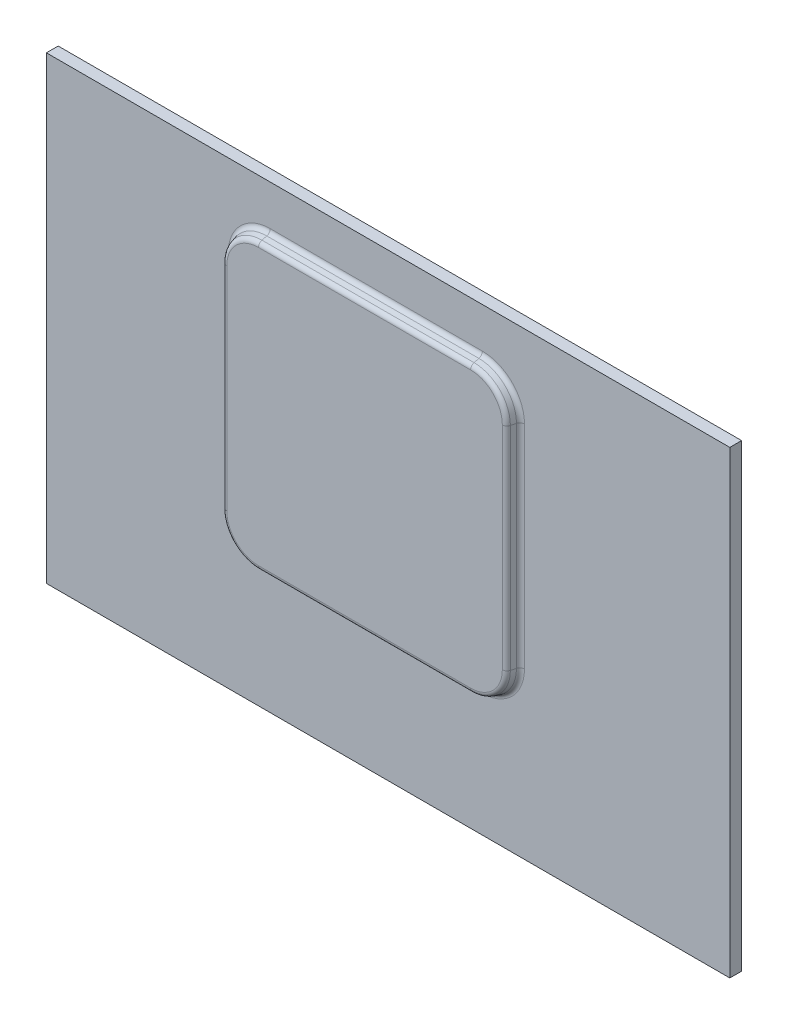
ISO-10303-21;
HEADER;
FILE_DESCRIPTION(('STEP AP214'),'2;1');
FILE_NAME('part.step','',(''),(''),'','','');
FILE_SCHEMA(('AUTOMOTIVE_DESIGN { 1 0 10303 214 1 1 1 1 }'));
ENDSEC;
DATA;
#1=APPLICATION_CONTEXT('core data for automotive mechanical design processes');
#2=APPLICATION_PROTOCOL_DEFINITION('international standard','automotive_design',2000,#1);
#3=PRODUCT_CONTEXT('',#1,'mechanical');
#4=PRODUCT('Part','Part','',(#3));
#5=PRODUCT_RELATED_PRODUCT_CATEGORY('part','',(#4));
#6=PRODUCT_DEFINITION_FORMATION('','',#4);
#7=PRODUCT_DEFINITION_CONTEXT('part definition',#1,'design');
#8=PRODUCT_DEFINITION('design','',#6,#7);
#9=PRODUCT_DEFINITION_SHAPE('','',#8);
#10=(LENGTH_UNIT() NAMED_UNIT(*) SI_UNIT(.MILLI.,.METRE.));
#11=(NAMED_UNIT(*) PLANE_ANGLE_UNIT() SI_UNIT($,.RADIAN.));
#12=(NAMED_UNIT(*) SI_UNIT($,.STERADIAN.) SOLID_ANGLE_UNIT());
#13=UNCERTAINTY_MEASURE_WITH_UNIT(LENGTH_MEASURE(1.E-05),#10,'distance_accuracy_value','');
#14=(GEOMETRIC_REPRESENTATION_CONTEXT(3) GLOBAL_UNCERTAINTY_ASSIGNED_CONTEXT((#13)) GLOBAL_UNIT_ASSIGNED_CONTEXT((#10,
#11,#12)) REPRESENTATION_CONTEXT('',''));
#15=CARTESIAN_POINT('',(0.,0.,0.));
#16=DIRECTION('',(0.,0.,1.));
#17=DIRECTION('',(1.,0.,0.));
#18=AXIS2_PLACEMENT_3D('',#15,#16,#17);
#19=CARTESIAN_POINT('',(-145.,-97.5,5.));
#20=DIRECTION('',(1.,0.,0.));
#21=DIRECTION('',(0.,0.,-1.));
#22=AXIS2_PLACEMENT_3D('',#19,#20,#21);
#23=PLANE('',#22);
#24=DIRECTION('',(0.,-1.,0.));
#25=VECTOR('',#24,1.);
#26=CARTESIAN_POINT('',(-145.,-97.5,0.));
#27=LINE('',#26,#25);
#28=CARTESIAN_POINT('',(-145.,97.5,0.));
#29=VERTEX_POINT('',#28);
#30=CARTESIAN_POINT('',(-145.,-97.5,0.));
#31=VERTEX_POINT('',#30);
#32=EDGE_CURVE('E199',#29,#31,#27,.T.);
#33=ORIENTED_EDGE('',*,*,#32,.T.);
#34=DIRECTION('',(0.,0.,-1.));
#35=VECTOR('',#34,1.);
#36=CARTESIAN_POINT('',(-145.,-97.5,5.));
#37=LINE('',#36,#35);
#38=CARTESIAN_POINT('',(-145.,-97.5,5.));
#39=VERTEX_POINT('',#38);
#40=EDGE_CURVE('E180',#39,#31,#37,.T.);
#41=ORIENTED_EDGE('',*,*,#40,.F.);
#42=DIRECTION('',(0.,-1.,0.));
#43=VECTOR('',#42,1.);
#44=CARTESIAN_POINT('',(-145.,-97.5,5.));
#45=LINE('',#44,#43);
#46=CARTESIAN_POINT('',(-145.,97.5,5.));
#47=VERTEX_POINT('',#46);
#48=EDGE_CURVE('E187',#47,#39,#45,.T.);
#49=ORIENTED_EDGE('',*,*,#48,.F.);
#50=DIRECTION('',(0.,0.,-1.));
#51=VECTOR('',#50,1.);
#52=CARTESIAN_POINT('',(-145.,97.5,5.));
#53=LINE('',#52,#51);
#54=EDGE_CURVE('E757',#47,#29,#53,.T.);
#55=ORIENTED_EDGE('',*,*,#54,.T.);
#56=EDGE_LOOP('',(#33,#41,#49,#55));
#57=FACE_BOUND('',#56,.T.);
#58=ADVANCED_FACE('F38',(#57),#23,.F.);
#59=CARTESIAN_POINT('',(145.,-97.5,5.));
#60=DIRECTION('',(0.,1.,0.));
#61=DIRECTION('',(-1.,0.,0.));
#62=AXIS2_PLACEMENT_3D('',#59,#60,#61);
#63=PLANE('',#62);
#64=DIRECTION('',(1.,0.,0.));
#65=VECTOR('',#64,1.);
#66=CARTESIAN_POINT('',(145.,-97.5,0.));
#67=LINE('',#66,#65);
#68=CARTESIAN_POINT('',(145.,-97.5,0.));
#69=VERTEX_POINT('',#68);
#70=EDGE_CURVE('E748',#31,#69,#67,.T.);
#71=ORIENTED_EDGE('',*,*,#70,.T.);
#72=DIRECTION('',(0.,0.,-1.));
#73=VECTOR('',#72,1.);
#74=CARTESIAN_POINT('',(145.,-97.5,5.));
#75=LINE('',#74,#73);
#76=CARTESIAN_POINT('',(145.,-97.5,5.));
#77=VERTEX_POINT('',#76);
#78=EDGE_CURVE('E183',#77,#69,#75,.T.);
#79=ORIENTED_EDGE('',*,*,#78,.F.);
#80=DIRECTION('',(1.,0.,0.));
#81=VECTOR('',#80,1.);
#82=CARTESIAN_POINT('',(145.,-97.5,5.));
#83=LINE('',#82,#81);
#84=EDGE_CURVE('E176',#39,#77,#83,.T.);
#85=ORIENTED_EDGE('',*,*,#84,.F.);
#86=ORIENTED_EDGE('',*,*,#40,.T.);
#87=EDGE_LOOP('',(#71,#79,#85,#86));
#88=FACE_BOUND('',#87,.T.);
#89=ADVANCED_FACE('F178',(#88),#63,.F.);
#90=CARTESIAN_POINT('',(145.,-97.5,5.));
#91=DIRECTION('',(-1.,0.,0.));
#92=DIRECTION('',(0.,0.,1.));
#93=AXIS2_PLACEMENT_3D('',#90,#91,#92);
#94=PLANE('',#93);
#95=DIRECTION('',(0.,1.,0.));
#96=VECTOR('',#95,1.);
#97=CARTESIAN_POINT('',(145.,-97.5,0.));
#98=LINE('',#97,#96);
#99=CARTESIAN_POINT('',(145.,97.5,0.));
#100=VERTEX_POINT('',#99);
#101=EDGE_CURVE('E750',#69,#100,#98,.T.);
#102=ORIENTED_EDGE('',*,*,#101,.T.);
#103=DIRECTION('',(0.,0.,-1.));
#104=VECTOR('',#103,1.);
#105=CARTESIAN_POINT('',(145.,97.5,5.));
#106=LINE('',#105,#104);
#107=CARTESIAN_POINT('',(145.,97.5,5.));
#108=VERTEX_POINT('',#107);
#109=EDGE_CURVE('E205',#108,#100,#106,.T.);
#110=ORIENTED_EDGE('',*,*,#109,.F.);
#111=DIRECTION('',(0.,1.,0.));
#112=VECTOR('',#111,1.);
#113=CARTESIAN_POINT('',(145.,-97.5,5.));
#114=LINE('',#113,#112);
#115=EDGE_CURVE('E186',#77,#108,#114,.T.);
#116=ORIENTED_EDGE('',*,*,#115,.F.);
#117=ORIENTED_EDGE('',*,*,#78,.T.);
#118=EDGE_LOOP('',(#102,#110,#116,#117));
#119=FACE_BOUND('',#118,.T.);
#120=ADVANCED_FACE('F444',(#119),#94,.F.);
#121=CARTESIAN_POINT('',(145.,97.5,5.));
#122=DIRECTION('',(0.,-1.,0.));
#123=DIRECTION('',(1.,0.,0.));
#124=AXIS2_PLACEMENT_3D('',#121,#122,#123);
#125=PLANE('',#124);
#126=DIRECTION('',(-1.,0.,0.));
#127=VECTOR('',#126,1.);
#128=CARTESIAN_POINT('',(145.,97.5,0.));
#129=LINE('',#128,#127);
#130=EDGE_CURVE('E196',#100,#29,#129,.T.);
#131=ORIENTED_EDGE('',*,*,#130,.T.);
#132=ORIENTED_EDGE('',*,*,#54,.F.);
#133=DIRECTION('',(-1.,0.,0.));
#134=VECTOR('',#133,1.);
#135=CARTESIAN_POINT('',(145.,97.5,5.));
#136=LINE('',#135,#134);
#137=EDGE_CURVE('E192',#108,#47,#136,.T.);
#138=ORIENTED_EDGE('',*,*,#137,.F.);
#139=ORIENTED_EDGE('',*,*,#109,.T.);
#140=EDGE_LOOP('',(#131,#132,#138,#139));
#141=FACE_BOUND('',#140,.T.);
#142=ADVANCED_FACE('F518',(#141),#125,.F.);
#143=CARTESIAN_POINT('',(0.,0.,5.));
#144=DIRECTION('',(0.,0.,1.));
#145=DIRECTION('',(1.,0.,0.));
#146=AXIS2_PLACEMENT_3D('',#143,#144,#145);
#147=PLANE('',#146);
#148=DIRECTION('',(-1.,0.,0.));
#149=VECTOR('',#148,1.);
#150=CARTESIAN_POINT('',(0.,-45.3743999381135,5.));
#151=LINE('',#150,#149);
#152=CARTESIAN_POINT('',(40.,-45.3743999381135,5.));
#153=VERTEX_POINT('',#152);
#154=CARTESIAN_POINT('',(-50.,-45.3743999381135,5.));
#155=VERTEX_POINT('',#154);
#156=EDGE_CURVE('E227',#153,#155,#151,.T.);
#157=ORIENTED_EDGE('',*,*,#156,.T.);
#158=CARTESIAN_POINT('',(-50.,-27.5,5.));
#159=DIRECTION('',(0.,0.,1.));
#160=DIRECTION('',(1.,0.,0.));
#161=AXIS2_PLACEMENT_3D('',#158,#159,#160);
#162=CIRCLE('',#161,17.8743999381135);
#163=CARTESIAN_POINT('',(-67.8743999381135,-27.5,5.));
#164=VERTEX_POINT('',#163);
#165=EDGE_CURVE('E243',#155,#164,#162,.F.);
#166=ORIENTED_EDGE('',*,*,#165,.T.);
#167=DIRECTION('',(0.,1.,0.));
#168=VECTOR('',#167,1.);
#169=CARTESIAN_POINT('',(-67.8743999381135,0.,5.));
#170=LINE('',#169,#168);
#171=CARTESIAN_POINT('',(-67.8743999381135,62.5,5.));
#172=VERTEX_POINT('',#171);
#173=EDGE_CURVE('E241',#164,#172,#170,.T.);
#174=ORIENTED_EDGE('',*,*,#173,.T.);
#175=CARTESIAN_POINT('',(-50.,62.5,5.));
#176=DIRECTION('',(0.,0.,1.));
#177=DIRECTION('',(1.,0.,0.));
#178=AXIS2_PLACEMENT_3D('',#175,#176,#177);
#179=CIRCLE('',#178,17.8743999381135);
#180=CARTESIAN_POINT('',(-49.9999999999999,80.3743999381136,5.));
#181=VERTEX_POINT('',#180);
#182=EDGE_CURVE('E239',#172,#181,#179,.F.);
#183=ORIENTED_EDGE('',*,*,#182,.T.);
#184=DIRECTION('',(1.,0.,0.));
#185=VECTOR('',#184,1.);
#186=CARTESIAN_POINT('',(0.,80.3743999381136,5.));
#187=LINE('',#186,#185);
#188=CARTESIAN_POINT('',(40.0000000000001,80.3743999381136,5.));
#189=VERTEX_POINT('',#188);
#190=EDGE_CURVE('E237',#181,#189,#187,.T.);
#191=ORIENTED_EDGE('',*,*,#190,.T.);
#192=CARTESIAN_POINT('',(40.0000000000001,62.5,5.));
#193=DIRECTION('',(0.,0.,1.));
#194=DIRECTION('',(1.,0.,0.));
#195=AXIS2_PLACEMENT_3D('',#192,#193,#194);
#196=CIRCLE('',#195,17.8743999381135);
#197=CARTESIAN_POINT('',(57.8743999381136,62.5,5.));
#198=VERTEX_POINT('',#197);
#199=EDGE_CURVE('E235',#189,#198,#196,.F.);
#200=ORIENTED_EDGE('',*,*,#199,.T.);
#201=DIRECTION('',(0.,-1.,0.));
#202=VECTOR('',#201,1.);
#203=CARTESIAN_POINT('',(57.8743999381136,0.,5.));
#204=LINE('',#203,#202);
#205=CARTESIAN_POINT('',(57.8743999381136,-27.5,5.));
#206=VERTEX_POINT('',#205);
#207=EDGE_CURVE('E233',#198,#206,#204,.T.);
#208=ORIENTED_EDGE('',*,*,#207,.T.);
#209=CARTESIAN_POINT('',(40.,-27.5,5.));
#210=DIRECTION('',(0.,0.,1.));
#211=DIRECTION('',(1.,0.,0.));
#212=AXIS2_PLACEMENT_3D('',#209,#210,#211);
#213=CIRCLE('',#212,17.8743999381135);
#214=EDGE_CURVE('E231',#206,#153,#213,.F.);
#215=ORIENTED_EDGE('',*,*,#214,.T.);
#216=EDGE_LOOP('',(#157,#166,#174,#183,#191,#200,#208,#215));
#217=FACE_BOUND('',#216,.T.);
#218=ORIENTED_EDGE('',*,*,#48,.T.);
#219=ORIENTED_EDGE('',*,*,#84,.T.);
#220=ORIENTED_EDGE('',*,*,#115,.T.);
#221=ORIENTED_EDGE('',*,*,#137,.T.);
#222=EDGE_LOOP('',(#218,#219,#220,#221));
#223=FACE_BOUND('',#222,.T.);
#224=ADVANCED_FACE('F190',(#217,#223),#147,.T.);
#225=CARTESIAN_POINT('',(0.,0.,0.));
#226=DIRECTION('',(0.,0.,1.));
#227=DIRECTION('',(1.,0.,0.));
#228=AXIS2_PLACEMENT_3D('',#225,#226,#227);
#229=PLANE('',#228);
#230=ORIENTED_EDGE('',*,*,#32,.F.);
#231=ORIENTED_EDGE('',*,*,#130,.F.);
#232=ORIENTED_EDGE('',*,*,#101,.F.);
#233=ORIENTED_EDGE('',*,*,#70,.F.);
#234=EDGE_LOOP('',(#230,#231,#232,#233));
#235=FACE_BOUND('',#234,.T.);
#236=ADVANCED_FACE('F450',(#235),#229,.F.);
#237=CARTESIAN_POINT('',(-64.9999999999999,77.5,10.));
#238=DIRECTION('',(-0.965925826289068,0.,0.258819045102521));
#239=DIRECTION('',(0.258819045102521,0.,0.965925826289068));
#240=AXIS2_PLACEMENT_3D('',#237,#238,#239);
#241=PLANE('',#240);
#242=DIRECTION('',(-0.258819045102521,0.,-0.965925826289068));
#243=VECTOR('',#242,1.);
#244=CARTESIAN_POINT('',(-64.9999999999999,62.5,10.));
#245=LINE('',#244,#243);
#246=CARTESIAN_POINT('',(-65.3971976766202,62.5,8.51763809020504));
#247=VERTEX_POINT('',#246);
#248=CARTESIAN_POINT('',(-65.9425482855354,62.5,6.48236190979496));
#249=VERTEX_POINT('',#248);
#250=EDGE_CURVE('E209',#247,#249,#245,.T.);
#251=ORIENTED_EDGE('',*,*,#250,.T.);
#252=DIRECTION('',(0.,-1.,0.));
#253=VECTOR('',#252,1.);
#254=CARTESIAN_POINT('',(-65.9425482855354,77.5,6.48236190979495));
#255=LINE('',#254,#253);
#256=CARTESIAN_POINT('',(-65.9425482855354,-27.5,6.48236190979495));
#257=VERTEX_POINT('',#256);
#258=EDGE_CURVE('E254',#249,#257,#255,.T.);
#259=ORIENTED_EDGE('',*,*,#258,.T.);
#260=DIRECTION('',(-0.258819045102521,0.,-0.965925826289068));
#261=VECTOR('',#260,1.);
#262=CARTESIAN_POINT('',(-64.9999999999999,-27.5,10.));
#263=LINE('',#262,#261);
#264=CARTESIAN_POINT('',(-65.3971976766202,-27.5,8.51763809020504));
#265=VERTEX_POINT('',#264);
#266=EDGE_CURVE('E212',#257,#265,#263,.F.);
#267=ORIENTED_EDGE('',*,*,#266,.T.);
#268=DIRECTION('',(0.,-1.,0.));
#269=VECTOR('',#268,1.);
#270=CARTESIAN_POINT('',(-65.3971976766202,77.5,8.51763809020505));
#271=LINE('',#270,#269);
#272=EDGE_CURVE('E252',#265,#247,#271,.F.);
#273=ORIENTED_EDGE('',*,*,#272,.T.);
#274=EDGE_LOOP('',(#251,#259,#267,#273));
#275=FACE_BOUND('',#274,.T.);
#276=ADVANCED_FACE('F394',(#275),#241,.T.);
#277=CARTESIAN_POINT('',(55.,-42.5,10.));
#278=DIRECTION('',(0.,-0.965925826289068,0.258819045102521));
#279=DIRECTION('',(0.,-0.258819045102521,-0.965925826289068));
#280=AXIS2_PLACEMENT_3D('',#277,#278,#279);
#281=PLANE('',#280);
#282=DIRECTION('',(0.,-0.258819045102521,-0.965925826289068));
#283=VECTOR('',#282,1.);
#284=CARTESIAN_POINT('',(-50.,-42.5,10.));
#285=LINE('',#284,#283);
#286=CARTESIAN_POINT('',(-50.,-42.8971976766202,8.51763809020504));
#287=VERTEX_POINT('',#286);
#288=CARTESIAN_POINT('',(-50.,-43.4425482855354,6.48236190979496));
#289=VERTEX_POINT('',#288);
#290=EDGE_CURVE('E203',#287,#289,#285,.T.);
#291=ORIENTED_EDGE('',*,*,#290,.T.);
#292=DIRECTION('',(1.,0.,0.));
#293=VECTOR('',#292,1.);
#294=CARTESIAN_POINT('',(55.,-43.4425482855354,6.48236190979496));
#295=LINE('',#294,#293);
#296=CARTESIAN_POINT('',(40.,-43.4425482855354,6.48236190979496));
#297=VERTEX_POINT('',#296);
#298=EDGE_CURVE('E12',#289,#297,#295,.T.);
#299=ORIENTED_EDGE('',*,*,#298,.T.);
#300=DIRECTION('',(0.,-0.258819045102521,-0.965925826289068));
#301=VECTOR('',#300,1.);
#302=CARTESIAN_POINT('',(40.,-42.5,10.));
#303=LINE('',#302,#301);
#304=CARTESIAN_POINT('',(40.,-42.8971976766202,8.51763809020504));
#305=VERTEX_POINT('',#304);
#306=EDGE_CURVE('E200',#297,#305,#303,.F.);
#307=ORIENTED_EDGE('',*,*,#306,.T.);
#308=DIRECTION('',(1.,0.,0.));
#309=VECTOR('',#308,1.);
#310=CARTESIAN_POINT('',(55.,-42.8971976766202,8.51763809020504));
#311=LINE('',#310,#309);
#312=EDGE_CURVE('E47',#305,#287,#311,.F.);
#313=ORIENTED_EDGE('',*,*,#312,.T.);
#314=EDGE_LOOP('',(#291,#299,#307,#313));
#315=FACE_BOUND('',#314,.T.);
#316=ADVANCED_FACE('F408',(#315),#281,.T.);
#317=CARTESIAN_POINT('',(55.0000000000001,77.5,10.));
#318=DIRECTION('',(0.965925826289068,0.,0.258819045102521));
#319=DIRECTION('',(0.258819045102521,0.,-0.965925826289068));
#320=AXIS2_PLACEMENT_3D('',#317,#318,#319);
#321=PLANE('',#320);
#322=DIRECTION('',(0.258819045102521,0.,-0.965925826289068));
#323=VECTOR('',#322,1.);
#324=CARTESIAN_POINT('',(55.,-27.5,10.));
#325=LINE('',#324,#323);
#326=CARTESIAN_POINT('',(55.3971976766203,-27.5,8.51763809020504));
#327=VERTEX_POINT('',#326);
#328=CARTESIAN_POINT('',(55.9425482855355,-27.5,6.48236190979496));
#329=VERTEX_POINT('',#328);
#330=EDGE_CURVE('E217',#327,#329,#325,.T.);
#331=ORIENTED_EDGE('',*,*,#330,.T.);
#332=DIRECTION('',(0.,1.,0.));
#333=VECTOR('',#332,1.);
#334=CARTESIAN_POINT('',(55.9425482855355,77.5,6.48236190979496));
#335=LINE('',#334,#333);
#336=CARTESIAN_POINT('',(55.9425482855355,62.5,6.48236190979495));
#337=VERTEX_POINT('',#336);
#338=EDGE_CURVE('E270',#329,#337,#335,.T.);
#339=ORIENTED_EDGE('',*,*,#338,.T.);
#340=DIRECTION('',(0.258819045102521,0.,-0.965925826289068));
#341=VECTOR('',#340,1.);
#342=CARTESIAN_POINT('',(55.0000000000001,62.5,10.));
#343=LINE('',#342,#341);
#344=CARTESIAN_POINT('',(55.3971976766203,62.5,8.51763809020504));
#345=VERTEX_POINT('',#344);
#346=EDGE_CURVE('E220',#337,#345,#343,.F.);
#347=ORIENTED_EDGE('',*,*,#346,.T.);
#348=DIRECTION('',(0.,1.,0.));
#349=VECTOR('',#348,1.);
#350=CARTESIAN_POINT('',(55.3971976766203,77.5,8.51763809020504));
#351=LINE('',#350,#349);
#352=EDGE_CURVE('E268',#345,#327,#351,.F.);
#353=ORIENTED_EDGE('',*,*,#352,.T.);
#354=EDGE_LOOP('',(#331,#339,#347,#353));
#355=FACE_BOUND('',#354,.T.);
#356=ADVANCED_FACE('F350',(#355),#321,.T.);
#357=CARTESIAN_POINT('',(55.0000000000001,77.5,10.));
#358=DIRECTION('',(0.,0.965925826289068,0.258819045102521));
#359=DIRECTION('',(0.,-0.258819045102521,0.965925826289068));
#360=AXIS2_PLACEMENT_3D('',#357,#358,#359);
#361=PLANE('',#360);
#362=DIRECTION('',(0.,0.258819045102521,-0.965925826289068));
#363=VECTOR('',#362,1.);
#364=CARTESIAN_POINT('',(40.0000000000001,77.5,10.));
#365=LINE('',#364,#363);
#366=CARTESIAN_POINT('',(40.0000000000001,77.8971976766203,8.51763809020504));
#367=VERTEX_POINT('',#366);
#368=CARTESIAN_POINT('',(40.0000000000001,78.4425482855354,6.48236190979496));
#369=VERTEX_POINT('',#368);
#370=EDGE_CURVE('E213',#367,#369,#365,.T.);
#371=ORIENTED_EDGE('',*,*,#370,.T.);
#372=DIRECTION('',(-1.,0.,0.));
#373=VECTOR('',#372,1.);
#374=CARTESIAN_POINT('',(55.0000000000001,78.4425482855354,6.48236190979496));
#375=LINE('',#374,#373);
#376=CARTESIAN_POINT('',(-49.9999999999999,78.4425482855354,6.48236190979495));
#377=VERTEX_POINT('',#376);
#378=EDGE_CURVE('E262',#369,#377,#375,.T.);
#379=ORIENTED_EDGE('',*,*,#378,.T.);
#380=DIRECTION('',(0.,0.258819045102521,-0.965925826289068));
#381=VECTOR('',#380,1.);
#382=CARTESIAN_POINT('',(-49.9999999999999,77.5,10.));
#383=LINE('',#382,#381);
#384=CARTESIAN_POINT('',(-49.9999999999999,77.8971976766202,8.51763809020504));
#385=VERTEX_POINT('',#384);
#386=EDGE_CURVE('E216',#377,#385,#383,.F.);
#387=ORIENTED_EDGE('',*,*,#386,.T.);
#388=DIRECTION('',(-1.,0.,0.));
#389=VECTOR('',#388,1.);
#390=CARTESIAN_POINT('',(55.0000000000001,77.8971976766203,8.51763809020504));
#391=LINE('',#390,#389);
#392=EDGE_CURVE('E260',#385,#367,#391,.F.);
#393=ORIENTED_EDGE('',*,*,#392,.T.);
#394=EDGE_LOOP('',(#371,#379,#387,#393));
#395=FACE_BOUND('',#394,.T.);
#396=ADVANCED_FACE('F373',(#395),#361,.T.);
#397=CARTESIAN_POINT('',(0.,0.,10.));
#398=DIRECTION('',(0.,0.,-1.));
#399=DIRECTION('',(-1.,0.,0.));
#400=AXIS2_PLACEMENT_3D('',#397,#398,#399);
#401=PLANE('',#400);
#402=DIRECTION('',(0.,1.,0.));
#403=VECTOR('',#402,1.);
#404=CARTESIAN_POINT('',(-63.465346024042,0.,10.));
#405=LINE('',#404,#403);
#406=CARTESIAN_POINT('',(-63.465346024042,62.5,10.));
#407=VERTEX_POINT('',#406);
#408=CARTESIAN_POINT('',(-63.465346024042,-27.5,10.));
#409=VERTEX_POINT('',#408);
#410=EDGE_CURVE('E55',#407,#409,#405,.F.);
#411=ORIENTED_EDGE('',*,*,#410,.T.);
#412=CARTESIAN_POINT('',(-50.,-27.5,10.));
#413=DIRECTION('',(0.,0.,-1.));
#414=DIRECTION('',(-1.,0.,0.));
#415=AXIS2_PLACEMENT_3D('',#412,#413,#414);
#416=CIRCLE('',#415,13.4653460240421);
#417=CARTESIAN_POINT('',(-50.,-40.9653460240421,10.));
#418=VERTEX_POINT('',#417);
#419=EDGE_CURVE('E288',#409,#418,#416,.F.);
#420=ORIENTED_EDGE('',*,*,#419,.T.);
#421=DIRECTION('',(-1.,0.,0.));
#422=VECTOR('',#421,1.);
#423=CARTESIAN_POINT('',(0.,-40.9653460240421,10.));
#424=LINE('',#423,#422);
#425=CARTESIAN_POINT('',(40.,-40.965346024042,10.));
#426=VERTEX_POINT('',#425);
#427=EDGE_CURVE('E276',#418,#426,#424,.F.);
#428=ORIENTED_EDGE('',*,*,#427,.T.);
#429=CARTESIAN_POINT('',(40.,-27.5,10.));
#430=DIRECTION('',(0.,0.,-1.));
#431=DIRECTION('',(-1.,0.,0.));
#432=AXIS2_PLACEMENT_3D('',#429,#430,#431);
#433=CIRCLE('',#432,13.4653460240421);
#434=CARTESIAN_POINT('',(53.4653460240421,-27.5,10.));
#435=VERTEX_POINT('',#434);
#436=EDGE_CURVE('E278',#426,#435,#433,.F.);
#437=ORIENTED_EDGE('',*,*,#436,.T.);
#438=DIRECTION('',(0.,-1.,0.));
#439=VECTOR('',#438,1.);
#440=CARTESIAN_POINT('',(53.4653460240421,0.,10.));
#441=LINE('',#440,#439);
#442=CARTESIAN_POINT('',(53.4653460240421,62.5,10.));
#443=VERTEX_POINT('',#442);
#444=EDGE_CURVE('E280',#435,#443,#441,.F.);
#445=ORIENTED_EDGE('',*,*,#444,.T.);
#446=CARTESIAN_POINT('',(40.0000000000001,62.5,10.));
#447=DIRECTION('',(0.,0.,-1.));
#448=DIRECTION('',(-1.,0.,0.));
#449=AXIS2_PLACEMENT_3D('',#446,#447,#448);
#450=CIRCLE('',#449,13.4653460240421);
#451=CARTESIAN_POINT('',(40.0000000000001,75.9653460240421,10.));
#452=VERTEX_POINT('',#451);
#453=EDGE_CURVE('E282',#443,#452,#450,.F.);
#454=ORIENTED_EDGE('',*,*,#453,.T.);
#455=DIRECTION('',(1.,0.,0.));
#456=VECTOR('',#455,1.);
#457=CARTESIAN_POINT('',(0.,75.9653460240421,10.));
#458=LINE('',#457,#456);
#459=CARTESIAN_POINT('',(-49.9999999999999,75.9653460240421,10.));
#460=VERTEX_POINT('',#459);
#461=EDGE_CURVE('E284',#452,#460,#458,.F.);
#462=ORIENTED_EDGE('',*,*,#461,.T.);
#463=CARTESIAN_POINT('',(-50.,62.5,10.));
#464=DIRECTION('',(0.,0.,-1.));
#465=DIRECTION('',(-1.,0.,0.));
#466=AXIS2_PLACEMENT_3D('',#463,#464,#465);
#467=CIRCLE('',#466,13.4653460240421);
#468=EDGE_CURVE('E60',#460,#407,#467,.F.);
#469=ORIENTED_EDGE('',*,*,#468,.T.);
#470=EDGE_LOOP('',(#411,#420,#428,#437,#445,#454,#462,#469));
#471=FACE_BOUND('',#470,.T.);
#472=ADVANCED_FACE('F455',(#471),#401,.F.);
#473=CARTESIAN_POINT('',(-50.,-27.5,10.));
#474=DIRECTION('',(0.,0.,-1.));
#475=DIRECTION('',(-1.,0.,0.));
#476=AXIS2_PLACEMENT_3D('',#473,#474,#475);
#477=CONICAL_SURFACE('',#476,15.,0.26179938779915);
#478=ORIENTED_EDGE('',*,*,#266,.F.);
#479=CARTESIAN_POINT('',(-50.,-27.5,6.48236190979496));
#480=DIRECTION('',(0.,0.,-1.));
#481=DIRECTION('',(-1.,0.,0.));
#482=AXIS2_PLACEMENT_3D('',#479,#480,#481);
#483=CIRCLE('',#482,15.9425482855354);
#484=EDGE_CURVE('E249',#257,#289,#483,.F.);
#485=ORIENTED_EDGE('',*,*,#484,.T.);
#486=ORIENTED_EDGE('',*,*,#290,.F.);
#487=CARTESIAN_POINT('',(-50.,-27.5,8.51763809020504));
#488=DIRECTION('',(0.,0.,-1.));
#489=DIRECTION('',(-1.,0.,0.));
#490=AXIS2_PLACEMENT_3D('',#487,#488,#489);
#491=CIRCLE('',#490,15.3971976766202);
#492=EDGE_CURVE('E246',#287,#265,#491,.T.);
#493=ORIENTED_EDGE('',*,*,#492,.T.);
#494=EDGE_LOOP('',(#478,#485,#486,#493));
#495=FACE_BOUND('',#494,.T.);
#496=ADVANCED_FACE('F397',(#495),#477,.T.);
#497=CARTESIAN_POINT('',(40.,-27.5,10.));
#498=DIRECTION('',(0.,0.,-1.));
#499=DIRECTION('',(-1.,0.,0.));
#500=AXIS2_PLACEMENT_3D('',#497,#498,#499);
#501=CONICAL_SURFACE('',#500,15.,0.26179938779915);
#502=ORIENTED_EDGE('',*,*,#306,.F.);
#503=CARTESIAN_POINT('',(40.,-27.5,6.48236190979496));
#504=DIRECTION('',(0.,0.,-1.));
#505=DIRECTION('',(-1.,0.,0.));
#506=AXIS2_PLACEMENT_3D('',#503,#504,#505);
#507=CIRCLE('',#506,15.9425482855354);
#508=EDGE_CURVE('E274',#297,#329,#507,.F.);
#509=ORIENTED_EDGE('',*,*,#508,.T.);
#510=ORIENTED_EDGE('',*,*,#330,.F.);
#511=CARTESIAN_POINT('',(40.,-27.5,8.51763809020504));
#512=DIRECTION('',(0.,0.,-1.));
#513=DIRECTION('',(-1.,0.,0.));
#514=AXIS2_PLACEMENT_3D('',#511,#512,#513);
#515=CIRCLE('',#514,15.3971976766202);
#516=EDGE_CURVE('E272',#327,#305,#515,.T.);
#517=ORIENTED_EDGE('',*,*,#516,.T.);
#518=EDGE_LOOP('',(#502,#509,#510,#517));
#519=FACE_BOUND('',#518,.T.);
#520=ADVANCED_FACE('F411',(#519),#501,.T.);
#521=CARTESIAN_POINT('',(-50.,62.5,10.));
#522=DIRECTION('',(0.,0.,-1.));
#523=DIRECTION('',(-1.,0.,0.));
#524=AXIS2_PLACEMENT_3D('',#521,#522,#523);
#525=CONICAL_SURFACE('',#524,15.,0.26179938779915);
#526=ORIENTED_EDGE('',*,*,#386,.F.);
#527=CARTESIAN_POINT('',(-50.,62.5,6.48236190979496));
#528=DIRECTION('',(0.,0.,-1.));
#529=DIRECTION('',(-1.,0.,0.));
#530=AXIS2_PLACEMENT_3D('',#527,#528,#529);
#531=CIRCLE('',#530,15.9425482855354);
#532=EDGE_CURVE('E258',#377,#249,#531,.F.);
#533=ORIENTED_EDGE('',*,*,#532,.T.);
#534=ORIENTED_EDGE('',*,*,#250,.F.);
#535=CARTESIAN_POINT('',(-50.,62.5,8.51763809020504));
#536=DIRECTION('',(0.,0.,-1.));
#537=DIRECTION('',(-1.,0.,0.));
#538=AXIS2_PLACEMENT_3D('',#535,#536,#537);
#539=CIRCLE('',#538,15.3971976766202);
#540=EDGE_CURVE('E256',#247,#385,#539,.T.);
#541=ORIENTED_EDGE('',*,*,#540,.T.);
#542=EDGE_LOOP('',(#526,#533,#534,#541));
#543=FACE_BOUND('',#542,.T.);
#544=ADVANCED_FACE('F377',(#543),#525,.T.);
#545=CARTESIAN_POINT('',(40.0000000000001,62.5,10.));
#546=DIRECTION('',(0.,0.,-1.));
#547=DIRECTION('',(-1.,0.,0.));
#548=AXIS2_PLACEMENT_3D('',#545,#546,#547);
#549=CONICAL_SURFACE('',#548,15.,0.26179938779915);
#550=ORIENTED_EDGE('',*,*,#346,.F.);
#551=CARTESIAN_POINT('',(40.0000000000001,62.5,6.48236190979496));
#552=DIRECTION('',(0.,0.,-1.));
#553=DIRECTION('',(-1.,0.,0.));
#554=AXIS2_PLACEMENT_3D('',#551,#552,#553);
#555=CIRCLE('',#554,15.9425482855354);
#556=EDGE_CURVE('E266',#337,#369,#555,.F.);
#557=ORIENTED_EDGE('',*,*,#556,.T.);
#558=ORIENTED_EDGE('',*,*,#370,.F.);
#559=CARTESIAN_POINT('',(40.0000000000001,62.5,8.51763809020504));
#560=DIRECTION('',(0.,0.,-1.));
#561=DIRECTION('',(-1.,0.,0.));
#562=AXIS2_PLACEMENT_3D('',#559,#560,#561);
#563=CIRCLE('',#562,15.3971976766202);
#564=EDGE_CURVE('E264',#367,#345,#563,.T.);
#565=ORIENTED_EDGE('',*,*,#564,.T.);
#566=EDGE_LOOP('',(#550,#557,#558,#565));
#567=FACE_BOUND('',#566,.T.);
#568=ADVANCED_FACE('F347',(#567),#549,.T.);
#569=CARTESIAN_POINT('',(40.0000000000001,62.5,7.));
#570=DIRECTION('',(0.,0.,1.));
#571=DIRECTION('',(1.,0.,0.));
#572=AXIS2_PLACEMENT_3D('',#569,#570,#571);
#573=TOROIDAL_SURFACE('',#572,17.8743999381135,2.);
#574=CARTESIAN_POINT('',(40.0000000000001,80.3743999381136,7.));
#575=DIRECTION('',(1.,0.,0.));
#576=DIRECTION('',(0.,0.,-1.));
#577=AXIS2_PLACEMENT_3D('',#574,#575,#576);
#578=CIRCLE('',#577,2.);
#579=EDGE_CURVE('E307',#369,#189,#578,.T.);
#580=ORIENTED_EDGE('',*,*,#579,.F.);
#581=ORIENTED_EDGE('',*,*,#556,.F.);
#582=CARTESIAN_POINT('',(57.8743999381136,62.5,7.));
#583=DIRECTION('',(0.,1.,0.));
#584=DIRECTION('',(0.,0.,1.));
#585=AXIS2_PLACEMENT_3D('',#582,#583,#584);
#586=CIRCLE('',#585,2.);
#587=EDGE_CURVE('E310',#198,#337,#586,.T.);
#588=ORIENTED_EDGE('',*,*,#587,.F.);
#589=ORIENTED_EDGE('',*,*,#199,.F.);
#590=EDGE_LOOP('',(#580,#581,#588,#589));
#591=FACE_BOUND('',#590,.T.);
#592=ADVANCED_FACE('F370',(#591),#573,.F.);
#593=CARTESIAN_POINT('',(57.8743999381136,77.5,7.));
#594=DIRECTION('',(0.,-1.,0.));
#595=DIRECTION('',(1.,0.,0.));
#596=AXIS2_PLACEMENT_3D('',#593,#594,#595);
#597=CYLINDRICAL_SURFACE('',#596,2.);
#598=ORIENTED_EDGE('',*,*,#587,.T.);
#599=ORIENTED_EDGE('',*,*,#338,.F.);
#600=CARTESIAN_POINT('',(57.8743999381136,-27.5,7.));
#601=DIRECTION('',(0.,1.,0.));
#602=DIRECTION('',(0.,0.,1.));
#603=AXIS2_PLACEMENT_3D('',#600,#601,#602);
#604=CIRCLE('',#603,2.);
#605=EDGE_CURVE('E304',#206,#329,#604,.T.);
#606=ORIENTED_EDGE('',*,*,#605,.F.);
#607=ORIENTED_EDGE('',*,*,#207,.F.);
#608=EDGE_LOOP('',(#598,#599,#606,#607));
#609=FACE_BOUND('',#608,.T.);
#610=ADVANCED_FACE('F355',(#609),#597,.F.);
#611=CARTESIAN_POINT('',(55.0000000000001,80.3743999381136,7.));
#612=DIRECTION('',(1.,0.,0.));
#613=DIRECTION('',(0.,1.,0.));
#614=AXIS2_PLACEMENT_3D('',#611,#612,#613);
#615=CYLINDRICAL_SURFACE('',#614,2.);
#616=ORIENTED_EDGE('',*,*,#579,.T.);
#617=ORIENTED_EDGE('',*,*,#190,.F.);
#618=CARTESIAN_POINT('',(-49.9999999999999,80.3743999381136,7.));
#619=DIRECTION('',(1.,0.,0.));
#620=DIRECTION('',(0.,0.,-1.));
#621=AXIS2_PLACEMENT_3D('',#618,#619,#620);
#622=CIRCLE('',#621,2.);
#623=EDGE_CURVE('E301',#377,#181,#622,.T.);
#624=ORIENTED_EDGE('',*,*,#623,.F.);
#625=ORIENTED_EDGE('',*,*,#378,.F.);
#626=EDGE_LOOP('',(#616,#617,#624,#625));
#627=FACE_BOUND('',#626,.T.);
#628=ADVANCED_FACE('F382',(#627),#615,.F.);
#629=CARTESIAN_POINT('',(40.,-27.5,7.));
#630=DIRECTION('',(0.,0.,1.));
#631=DIRECTION('',(1.,0.,0.));
#632=AXIS2_PLACEMENT_3D('',#629,#630,#631);
#633=TOROIDAL_SURFACE('',#632,17.8743999381135,2.);
#634=ORIENTED_EDGE('',*,*,#605,.T.);
#635=ORIENTED_EDGE('',*,*,#508,.F.);
#636=CARTESIAN_POINT('',(40.,-45.3743999381135,7.));
#637=DIRECTION('',(1.,0.,0.));
#638=DIRECTION('',(0.,0.,-1.));
#639=AXIS2_PLACEMENT_3D('',#636,#637,#638);
#640=CIRCLE('',#639,2.);
#641=EDGE_CURVE('E298',#153,#297,#640,.T.);
#642=ORIENTED_EDGE('',*,*,#641,.F.);
#643=ORIENTED_EDGE('',*,*,#214,.F.);
#644=EDGE_LOOP('',(#634,#635,#642,#643));
#645=FACE_BOUND('',#644,.T.);
#646=ADVANCED_FACE('F361',(#645),#633,.F.);
#647=CARTESIAN_POINT('',(-50.,62.5,7.));
#648=DIRECTION('',(0.,0.,1.));
#649=DIRECTION('',(1.,0.,0.));
#650=AXIS2_PLACEMENT_3D('',#647,#648,#649);
#651=TOROIDAL_SURFACE('',#650,17.8743999381135,2.);
#652=ORIENTED_EDGE('',*,*,#623,.T.);
#653=ORIENTED_EDGE('',*,*,#182,.F.);
#654=CARTESIAN_POINT('',(-67.8743999381135,62.5,7.));
#655=DIRECTION('',(0.,1.,0.));
#656=DIRECTION('',(0.,0.,1.));
#657=AXIS2_PLACEMENT_3D('',#654,#655,#656);
#658=CIRCLE('',#657,2.);
#659=EDGE_CURVE('E295',#249,#172,#658,.T.);
#660=ORIENTED_EDGE('',*,*,#659,.F.);
#661=ORIENTED_EDGE('',*,*,#532,.F.);
#662=EDGE_LOOP('',(#652,#653,#660,#661));
#663=FACE_BOUND('',#662,.T.);
#664=ADVANCED_FACE('F386',(#663),#651,.F.);
#665=CARTESIAN_POINT('',(55.,-45.3743999381135,7.));
#666=DIRECTION('',(-1.,0.,0.));
#667=DIRECTION('',(0.,-1.,0.));
#668=AXIS2_PLACEMENT_3D('',#665,#666,#667);
#669=CYLINDRICAL_SURFACE('',#668,2.);
#670=ORIENTED_EDGE('',*,*,#641,.T.);
#671=ORIENTED_EDGE('',*,*,#298,.F.);
#672=CARTESIAN_POINT('',(-50.,-45.3743999381135,7.));
#673=DIRECTION('',(1.,0.,0.));
#674=DIRECTION('',(0.,0.,-1.));
#675=AXIS2_PLACEMENT_3D('',#672,#673,#674);
#676=CIRCLE('',#675,2.);
#677=EDGE_CURVE('E293',#155,#289,#676,.T.);
#678=ORIENTED_EDGE('',*,*,#677,.F.);
#679=ORIENTED_EDGE('',*,*,#156,.F.);
#680=EDGE_LOOP('',(#670,#671,#678,#679));
#681=FACE_BOUND('',#680,.T.);
#682=ADVANCED_FACE('F405',(#681),#669,.F.);
#683=CARTESIAN_POINT('',(-67.8743999381135,77.5,7.));
#684=DIRECTION('',(0.,1.,0.));
#685=DIRECTION('',(0.,0.,1.));
#686=AXIS2_PLACEMENT_3D('',#683,#684,#685);
#687=CYLINDRICAL_SURFACE('',#686,2.);
#688=ORIENTED_EDGE('',*,*,#659,.T.);
#689=ORIENTED_EDGE('',*,*,#173,.F.);
#690=CARTESIAN_POINT('',(-67.8743999381135,-27.5,7.));
#691=DIRECTION('',(0.,1.,0.));
#692=DIRECTION('',(0.,0.,1.));
#693=AXIS2_PLACEMENT_3D('',#690,#691,#692);
#694=CIRCLE('',#693,2.);
#695=EDGE_CURVE('E291',#257,#164,#694,.T.);
#696=ORIENTED_EDGE('',*,*,#695,.F.);
#697=ORIENTED_EDGE('',*,*,#258,.F.);
#698=EDGE_LOOP('',(#688,#689,#696,#697));
#699=FACE_BOUND('',#698,.T.);
#700=ADVANCED_FACE('F391',(#699),#687,.F.);
#701=CARTESIAN_POINT('',(-50.,-27.5,7.));
#702=DIRECTION('',(0.,0.,1.));
#703=DIRECTION('',(1.,0.,0.));
#704=AXIS2_PLACEMENT_3D('',#701,#702,#703);
#705=TOROIDAL_SURFACE('',#704,17.8743999381135,2.);
#706=ORIENTED_EDGE('',*,*,#677,.T.);
#707=ORIENTED_EDGE('',*,*,#484,.F.);
#708=ORIENTED_EDGE('',*,*,#695,.T.);
#709=ORIENTED_EDGE('',*,*,#165,.F.);
#710=EDGE_LOOP('',(#706,#707,#708,#709));
#711=FACE_BOUND('',#710,.T.);
#712=ADVANCED_FACE('F401',(#711),#705,.F.);
#713=CARTESIAN_POINT('',(40.0000000000001,62.5,8.));
#714=DIRECTION('',(0.,0.,-1.));
#715=DIRECTION('',(-1.,0.,0.));
#716=AXIS2_PLACEMENT_3D('',#713,#714,#715);
#717=TOROIDAL_SURFACE('',#716,13.4653460240421,2.);
#718=CARTESIAN_POINT('',(53.4653460240421,62.5,8.));
#719=DIRECTION('',(0.,-1.,0.));
#720=DIRECTION('',(0.,0.,-1.));
#721=AXIS2_PLACEMENT_3D('',#718,#719,#720);
#722=CIRCLE('',#721,2.);
#723=EDGE_CURVE('E328',#345,#443,#722,.T.);
#724=ORIENTED_EDGE('',*,*,#723,.F.);
#725=ORIENTED_EDGE('',*,*,#564,.F.);
#726=CARTESIAN_POINT('',(40.0000000000001,75.9653460240421,8.));
#727=DIRECTION('',(-1.,0.,0.));
#728=DIRECTION('',(0.,0.,1.));
#729=AXIS2_PLACEMENT_3D('',#726,#727,#728);
#730=CIRCLE('',#729,2.);
#731=EDGE_CURVE('E42',#452,#367,#730,.T.);
#732=ORIENTED_EDGE('',*,*,#731,.F.);
#733=ORIENTED_EDGE('',*,*,#453,.F.);
#734=EDGE_LOOP('',(#724,#725,#732,#733));
#735=FACE_BOUND('',#734,.T.);
#736=ADVANCED_FACE('F40',(#735),#717,.T.);
#737=CARTESIAN_POINT('',(0.,75.9653460240421,8.));
#738=DIRECTION('',(1.,0.,0.));
#739=DIRECTION('',(0.,1.,0.));
#740=AXIS2_PLACEMENT_3D('',#737,#738,#739);
#741=CYLINDRICAL_SURFACE('',#740,2.);
#742=ORIENTED_EDGE('',*,*,#731,.T.);
#743=ORIENTED_EDGE('',*,*,#392,.F.);
#744=CARTESIAN_POINT('',(-49.9999999999999,75.9653460240421,8.));
#745=DIRECTION('',(-1.,0.,0.));
#746=DIRECTION('',(0.,-1.,0.));
#747=AXIS2_PLACEMENT_3D('',#744,#745,#746);
#748=CIRCLE('',#747,2.);
#749=EDGE_CURVE('E326',#460,#385,#748,.T.);
#750=ORIENTED_EDGE('',*,*,#749,.F.);
#751=ORIENTED_EDGE('',*,*,#461,.F.);
#752=EDGE_LOOP('',(#742,#743,#750,#751));
#753=FACE_BOUND('',#752,.T.);
#754=ADVANCED_FACE('F339',(#753),#741,.T.);
#755=CARTESIAN_POINT('',(53.4653460240421,0.,8.));
#756=DIRECTION('',(0.,-1.,0.));
#757=DIRECTION('',(1.,0.,0.));
#758=AXIS2_PLACEMENT_3D('',#755,#756,#757);
#759=CYLINDRICAL_SURFACE('',#758,2.);
#760=ORIENTED_EDGE('',*,*,#723,.T.);
#761=ORIENTED_EDGE('',*,*,#444,.F.);
#762=CARTESIAN_POINT('',(53.4653460240421,-27.5,8.));
#763=DIRECTION('',(0.,-1.,0.));
#764=DIRECTION('',(0.,0.,-1.));
#765=AXIS2_PLACEMENT_3D('',#762,#763,#764);
#766=CIRCLE('',#765,2.);
#767=EDGE_CURVE('E323',#327,#435,#766,.T.);
#768=ORIENTED_EDGE('',*,*,#767,.F.);
#769=ORIENTED_EDGE('',*,*,#352,.F.);
#770=EDGE_LOOP('',(#760,#761,#768,#769));
#771=FACE_BOUND('',#770,.T.);
#772=ADVANCED_FACE('F431',(#771),#759,.T.);
#773=CARTESIAN_POINT('',(-50.,62.5,8.));
#774=DIRECTION('',(0.,0.,-1.));
#775=DIRECTION('',(-1.,0.,0.));
#776=AXIS2_PLACEMENT_3D('',#773,#774,#775);
#777=TOROIDAL_SURFACE('',#776,13.4653460240421,2.);
#778=ORIENTED_EDGE('',*,*,#749,.T.);
#779=ORIENTED_EDGE('',*,*,#540,.F.);
#780=CARTESIAN_POINT('',(-63.465346024042,62.5,8.));
#781=DIRECTION('',(0.,-1.,0.));
#782=DIRECTION('',(0.,0.,-1.));
#783=AXIS2_PLACEMENT_3D('',#780,#781,#782);
#784=CIRCLE('',#783,2.);
#785=EDGE_CURVE('E320',#407,#247,#784,.T.);
#786=ORIENTED_EDGE('',*,*,#785,.F.);
#787=ORIENTED_EDGE('',*,*,#468,.F.);
#788=EDGE_LOOP('',(#778,#779,#786,#787));
#789=FACE_BOUND('',#788,.T.);
#790=ADVANCED_FACE('F429',(#789),#777,.T.);
#791=CARTESIAN_POINT('',(40.,-27.5,8.));
#792=DIRECTION('',(0.,0.,-1.));
#793=DIRECTION('',(-1.,0.,0.));
#794=AXIS2_PLACEMENT_3D('',#791,#792,#793);
#795=TOROIDAL_SURFACE('',#794,13.4653460240421,2.);
#796=ORIENTED_EDGE('',*,*,#767,.T.);
#797=ORIENTED_EDGE('',*,*,#436,.F.);
#798=CARTESIAN_POINT('',(40.,-40.965346024042,8.));
#799=DIRECTION('',(-1.,0.,0.));
#800=DIRECTION('',(0.,0.,1.));
#801=AXIS2_PLACEMENT_3D('',#798,#799,#800);
#802=CIRCLE('',#801,2.);
#803=EDGE_CURVE('E317',#305,#426,#802,.T.);
#804=ORIENTED_EDGE('',*,*,#803,.F.);
#805=ORIENTED_EDGE('',*,*,#516,.F.);
#806=EDGE_LOOP('',(#796,#797,#804,#805));
#807=FACE_BOUND('',#806,.T.);
#808=ADVANCED_FACE('F415',(#807),#795,.T.);
#809=CARTESIAN_POINT('',(-63.465346024042,0.,8.));
#810=DIRECTION('',(0.,1.,0.));
#811=DIRECTION('',(0.,0.,1.));
#812=AXIS2_PLACEMENT_3D('',#809,#810,#811);
#813=CYLINDRICAL_SURFACE('',#812,2.);
#814=ORIENTED_EDGE('',*,*,#785,.T.);
#815=ORIENTED_EDGE('',*,*,#272,.F.);
#816=CARTESIAN_POINT('',(-63.465346024042,-27.5,8.));
#817=DIRECTION('',(0.,-1.,0.));
#818=DIRECTION('',(0.,0.,-1.));
#819=AXIS2_PLACEMENT_3D('',#816,#817,#818);
#820=CIRCLE('',#819,2.);
#821=EDGE_CURVE('E315',#409,#265,#820,.T.);
#822=ORIENTED_EDGE('',*,*,#821,.F.);
#823=ORIENTED_EDGE('',*,*,#410,.F.);
#824=EDGE_LOOP('',(#814,#815,#822,#823));
#825=FACE_BOUND('',#824,.T.);
#826=ADVANCED_FACE('F427',(#825),#813,.T.);
#827=CARTESIAN_POINT('',(0.,-40.9653460240421,8.));
#828=DIRECTION('',(-1.,0.,0.));
#829=DIRECTION('',(0.,-1.,0.));
#830=AXIS2_PLACEMENT_3D('',#827,#828,#829);
#831=CYLINDRICAL_SURFACE('',#830,2.);
#832=ORIENTED_EDGE('',*,*,#803,.T.);
#833=ORIENTED_EDGE('',*,*,#427,.F.);
#834=CARTESIAN_POINT('',(-50.,-40.9653460240421,8.));
#835=DIRECTION('',(-1.,0.,0.));
#836=DIRECTION('',(0.,0.,1.));
#837=AXIS2_PLACEMENT_3D('',#834,#835,#836);
#838=CIRCLE('',#837,2.);
#839=EDGE_CURVE('E313',#287,#418,#838,.T.);
#840=ORIENTED_EDGE('',*,*,#839,.F.);
#841=ORIENTED_EDGE('',*,*,#312,.F.);
#842=EDGE_LOOP('',(#832,#833,#840,#841));
#843=FACE_BOUND('',#842,.T.);
#844=ADVANCED_FACE('F421',(#843),#831,.T.);
#845=CARTESIAN_POINT('',(-50.,-27.5,8.));
#846=DIRECTION('',(0.,0.,-1.));
#847=DIRECTION('',(-1.,0.,0.));
#848=AXIS2_PLACEMENT_3D('',#845,#846,#847);
#849=TOROIDAL_SURFACE('',#848,13.4653460240421,2.);
#850=ORIENTED_EDGE('',*,*,#821,.T.);
#851=ORIENTED_EDGE('',*,*,#492,.F.);
#852=ORIENTED_EDGE('',*,*,#839,.T.);
#853=ORIENTED_EDGE('',*,*,#419,.F.);
#854=EDGE_LOOP('',(#850,#851,#852,#853));
#855=FACE_BOUND('',#854,.T.);
#856=ADVANCED_FACE('F423',(#855),#849,.T.);
#857=CLOSED_SHELL('',(#58,#89,#120,#142,#224,#236,#276,#316,#356,#396,#472,#496,#520,#544,#568,
#592,#610,#628,#646,#664,#682,#700,#712,#736,#754,#772,#790,#808,#826,#844,#856));
#858=MANIFOLD_SOLID_BREP('B2',#857);
#859=ADVANCED_BREP_SHAPE_REPRESENTATION('',(#18,#858),#14);
#860=SHAPE_DEFINITION_REPRESENTATION(#9,#859);
ENDSEC;
END-ISO-10303-21;
